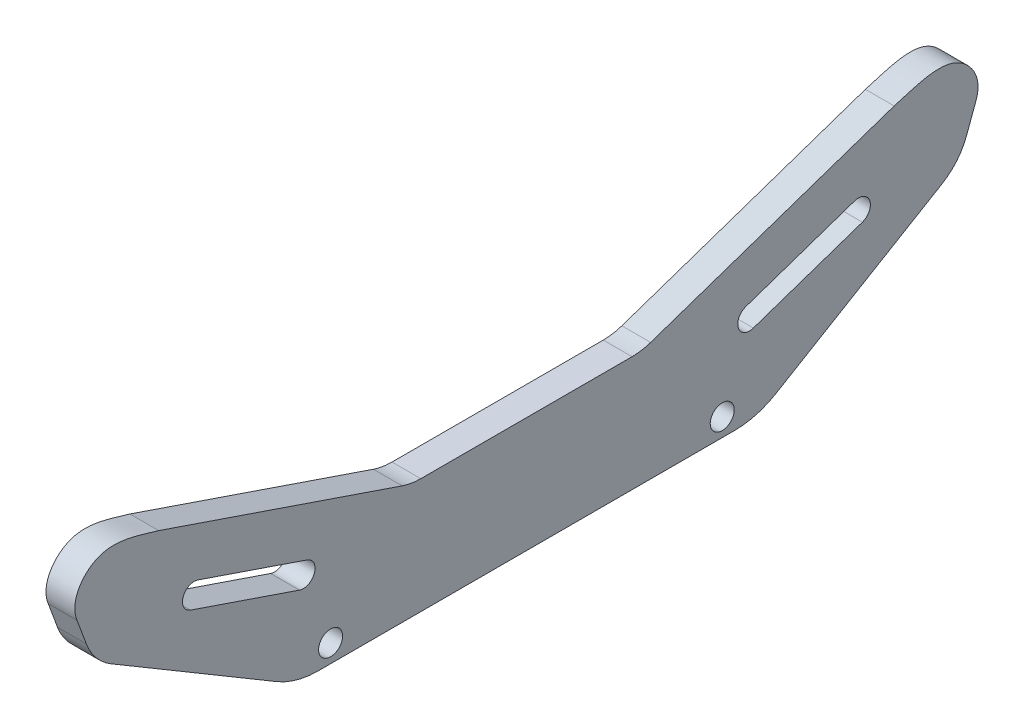
ISO-10303-21;
HEADER;
FILE_DESCRIPTION(('STEP AP214'),'2;1');
FILE_NAME('part.step','',(''),(''),'','','');
FILE_SCHEMA(('AUTOMOTIVE_DESIGN { 1 0 10303 214 1 1 1 1 }'));
ENDSEC;
DATA;
#1=APPLICATION_CONTEXT('core data for automotive mechanical design processes');
#2=APPLICATION_PROTOCOL_DEFINITION('international standard','automotive_design',2000,#1);
#3=PRODUCT_CONTEXT('',#1,'mechanical');
#4=PRODUCT('Part','Part','',(#3));
#5=PRODUCT_RELATED_PRODUCT_CATEGORY('part','',(#4));
#6=PRODUCT_DEFINITION_FORMATION('','',#4);
#7=PRODUCT_DEFINITION_CONTEXT('part definition',#1,'design');
#8=PRODUCT_DEFINITION('design','',#6,#7);
#9=PRODUCT_DEFINITION_SHAPE('','',#8);
#10=(LENGTH_UNIT() NAMED_UNIT(*) SI_UNIT(.MILLI.,.METRE.));
#11=(NAMED_UNIT(*) PLANE_ANGLE_UNIT() SI_UNIT($,.RADIAN.));
#12=(NAMED_UNIT(*) SI_UNIT($,.STERADIAN.) SOLID_ANGLE_UNIT());
#13=UNCERTAINTY_MEASURE_WITH_UNIT(LENGTH_MEASURE(1.E-05),#10,'distance_accuracy_value','');
#14=(GEOMETRIC_REPRESENTATION_CONTEXT(3) GLOBAL_UNCERTAINTY_ASSIGNED_CONTEXT((#13)) GLOBAL_UNIT_ASSIGNED_CONTEXT((#10,
#11,#12)) REPRESENTATION_CONTEXT('',''));
#15=CARTESIAN_POINT('',(0.,0.,0.));
#16=DIRECTION('',(0.,0.,1.));
#17=DIRECTION('',(1.,0.,0.));
#18=AXIS2_PLACEMENT_3D('',#15,#16,#17);
#19=CARTESIAN_POINT('',(6.35,0.,50.8));
#20=DIRECTION('',(0.,0.860067915947506,-0.510179556585437));
#21=DIRECTION('',(0.,0.510179556585437,0.860067915947507));
#22=AXIS2_PLACEMENT_3D('',#19,#20,#21);
#23=PLANE('',#22);
#24=DIRECTION('',(0.,-0.510179556585437,-0.860067915947506));
#25=VECTOR('',#24,1.);
#26=CARTESIAN_POINT('',(0.,0.,50.8));
#27=LINE('',#26,#25);
#28=CARTESIAN_POINT('',(0.,24.212684560183,91.6180862607409));
#29=VERTEX_POINT('',#28);
#30=CARTESIAN_POINT('',(0.,2.48799245445334,54.9942928868347));
#31=VERTEX_POINT('',#30);
#32=EDGE_CURVE('E269',#29,#31,#27,.T.);
#33=ORIENTED_EDGE('',*,*,#32,.T.);
#34=DIRECTION('',(-1.,0.,0.));
#35=VECTOR('',#34,1.);
#36=CARTESIAN_POINT('',(6.35,2.48799245445334,54.9942928868347));
#37=LINE('',#36,#35);
#38=CARTESIAN_POINT('',(6.35,2.48799245445334,54.9942928868347));
#39=VERTEX_POINT('',#38);
#40=EDGE_CURVE('E55',#31,#39,#37,.F.);
#41=ORIENTED_EDGE('',*,*,#40,.T.);
#42=DIRECTION('',(0.,-0.510179556585437,-0.860067915947506));
#43=VECTOR('',#42,1.);
#44=CARTESIAN_POINT('',(6.35,0.,50.8));
#45=LINE('',#44,#43);
#46=CARTESIAN_POINT('',(6.35,24.212684560183,91.6180862607409));
#47=VERTEX_POINT('',#46);
#48=EDGE_CURVE('E276',#47,#39,#45,.T.);
#49=ORIENTED_EDGE('',*,*,#48,.F.);
#50=DIRECTION('',(-1.,0.,0.));
#51=VECTOR('',#50,1.);
#52=CARTESIAN_POINT('',(6.35,24.212684560183,91.6180862607409));
#53=LINE('',#52,#51);
#54=EDGE_CURVE('E380',#47,#29,#53,.T.);
#55=ORIENTED_EDGE('',*,*,#54,.T.);
#56=EDGE_LOOP('',(#33,#41,#49,#55));
#57=FACE_BOUND('',#56,.T.);
#58=ADVANCED_FACE('F32',(#57),#23,.F.);
#59=CARTESIAN_POINT('',(6.35,0.,-50.8));
#60=DIRECTION('',(0.,1.,0.));
#61=DIRECTION('',(0.,0.,1.));
#62=AXIS2_PLACEMENT_3D('',#59,#60,#61);
#63=PLANE('',#62);
#64=DIRECTION('',(0.,0.,-1.));
#65=VECTOR('',#64,1.);
#66=CARTESIAN_POINT('',(6.35,0.,-50.8));
#67=LINE('',#66,#65);
#68=CARTESIAN_POINT('',(6.35,0.,45.9233003707457));
#69=VERTEX_POINT('',#68);
#70=CARTESIAN_POINT('',(6.35,0.,-45.9233003707457));
#71=VERTEX_POINT('',#70);
#72=EDGE_CURVE('E278',#69,#71,#67,.T.);
#73=ORIENTED_EDGE('',*,*,#72,.F.);
#74=DIRECTION('',(-1.,0.,0.));
#75=VECTOR('',#74,1.);
#76=CARTESIAN_POINT('',(6.35,0.,45.9233003707457));
#77=LINE('',#76,#75);
#78=CARTESIAN_POINT('',(0.,0.,45.9233003707457));
#79=VERTEX_POINT('',#78);
#80=EDGE_CURVE('E343',#69,#79,#77,.T.);
#81=ORIENTED_EDGE('',*,*,#80,.T.);
#82=DIRECTION('',(0.,0.,-1.));
#83=VECTOR('',#82,1.);
#84=CARTESIAN_POINT('',(0.,0.,-50.8));
#85=LINE('',#84,#83);
#86=CARTESIAN_POINT('',(0.,0.,-45.9233003707457));
#87=VERTEX_POINT('',#86);
#88=EDGE_CURVE('E434',#79,#87,#85,.T.);
#89=ORIENTED_EDGE('',*,*,#88,.T.);
#90=DIRECTION('',(-1.,0.,0.));
#91=VECTOR('',#90,1.);
#92=CARTESIAN_POINT('',(6.35,0.,-45.9233003707457));
#93=LINE('',#92,#91);
#94=EDGE_CURVE('E353',#87,#71,#93,.F.);
#95=ORIENTED_EDGE('',*,*,#94,.T.);
#96=EDGE_LOOP('',(#73,#81,#89,#95));
#97=FACE_BOUND('',#96,.T.);
#98=ADVANCED_FACE('F310',(#97),#63,.F.);
#99=CARTESIAN_POINT('',(6.35,0.,-50.8));
#100=DIRECTION('',(0.,0.860067915947506,0.510179556585437));
#101=DIRECTION('',(0.,-0.510179556585437,0.860067915947507));
#102=AXIS2_PLACEMENT_3D('',#99,#100,#101);
#103=PLANE('',#102);
#104=DIRECTION('',(0.,0.510179556585437,-0.860067915947506));
#105=VECTOR('',#104,1.);
#106=CARTESIAN_POINT('',(6.35,0.,-50.8));
#107=LINE('',#106,#105);
#108=CARTESIAN_POINT('',(6.35,2.48799245445333,-54.9942928868347));
#109=VERTEX_POINT('',#108);
#110=CARTESIAN_POINT('',(6.35,24.212684560183,-91.6180862607409));
#111=VERTEX_POINT('',#110);
#112=EDGE_CURVE('E281',#109,#111,#107,.T.);
#113=ORIENTED_EDGE('',*,*,#112,.F.);
#114=DIRECTION('',(-1.,0.,0.));
#115=VECTOR('',#114,1.);
#116=CARTESIAN_POINT('',(6.35,2.48799245445333,-54.9942928868347));
#117=LINE('',#116,#115);
#118=CARTESIAN_POINT('',(0.,2.48799245445333,-54.9942928868347));
#119=VERTEX_POINT('',#118);
#120=EDGE_CURVE('E11',#109,#119,#117,.T.);
#121=ORIENTED_EDGE('',*,*,#120,.T.);
#122=DIRECTION('',(0.,0.510179556585437,-0.860067915947506));
#123=VECTOR('',#122,1.);
#124=CARTESIAN_POINT('',(0.,0.,-50.8));
#125=LINE('',#124,#123);
#126=CARTESIAN_POINT('',(0.,24.212684560183,-91.6180862607409));
#127=VERTEX_POINT('',#126);
#128=EDGE_CURVE('E432',#119,#127,#125,.T.);
#129=ORIENTED_EDGE('',*,*,#128,.T.);
#130=DIRECTION('',(-1.,0.,0.));
#131=VECTOR('',#130,1.);
#132=CARTESIAN_POINT('',(6.35,24.212684560183,-91.6180862607409));
#133=LINE('',#132,#131);
#134=EDGE_CURVE('E363',#127,#111,#133,.F.);
#135=ORIENTED_EDGE('',*,*,#134,.T.);
#136=EDGE_LOOP('',(#113,#121,#129,#135));
#137=FACE_BOUND('',#136,.T.);
#138=ADVANCED_FACE('F306',(#137),#103,.F.);
#139=CARTESIAN_POINT('',(6.35,26.5105805189183,-95.4919117850742));
#140=DIRECTION('',(0.,0.346441344115629,0.938071636436875));
#141=DIRECTION('',(0.,-0.938071636436875,0.346441344115629));
#142=AXIS2_PLACEMENT_3D('',#139,#140,#141);
#143=PLANE('',#142);
#144=DIRECTION('',(0.,0.938071636436875,-0.346441344115629));
#145=VECTOR('',#144,1.);
#146=CARTESIAN_POINT('',(6.35,26.5105805189183,-95.4919117850742));
#147=LINE('',#146,#145);
#148=CARTESIAN_POINT('',(6.35,30.7357420224478,-97.0523156748542));
#149=VERTEX_POINT('',#148);
#150=CARTESIAN_POINT('',(6.35,36.2672226233802,-99.0951592060961));
#151=VERTEX_POINT('',#150);
#152=EDGE_CURVE('E283',#149,#151,#147,.T.);
#153=ORIENTED_EDGE('',*,*,#152,.F.);
#154=DIRECTION('',(-1.,0.,0.));
#155=VECTOR('',#154,1.);
#156=CARTESIAN_POINT('',(6.35,30.7357420224478,-97.0523156748542));
#157=LINE('',#156,#155);
#158=CARTESIAN_POINT('',(0.,30.7357420224478,-97.0523156748542));
#159=VERTEX_POINT('',#158);
#160=EDGE_CURVE('E366',#149,#159,#157,.T.);
#161=ORIENTED_EDGE('',*,*,#160,.T.);
#162=DIRECTION('',(0.,0.938071636436875,-0.346441344115629));
#163=VECTOR('',#162,1.);
#164=CARTESIAN_POINT('',(0.,26.5105805189183,-95.4919117850742));
#165=LINE('',#164,#163);
#166=CARTESIAN_POINT('',(0.,36.2672226233802,-99.0951592060961));
#167=VERTEX_POINT('',#166);
#168=EDGE_CURVE('E427',#159,#167,#165,.T.);
#169=ORIENTED_EDGE('',*,*,#168,.T.);
#170=DIRECTION('',(-1.,0.,0.));
#171=VECTOR('',#170,1.);
#172=CARTESIAN_POINT('',(6.35,36.2672226233802,-99.0951592060961));
#173=LINE('',#172,#171);
#174=EDGE_CURVE('E393',#151,#167,#173,.T.);
#175=ORIENTED_EDGE('',*,*,#174,.F.);
#176=EDGE_LOOP('',(#153,#161,#169,#175));
#177=FACE_BOUND('',#176,.T.);
#178=ADVANCED_FACE('F301',(#177),#143,.F.);
#179=CARTESIAN_POINT('',(6.35,36.2672226233802,-99.0951592060961));
#180=CARTESIAN_POINT('',(6.35,40.4841579147498,-100.787803101109));
#181=CARTESIAN_POINT('',(6.35,49.4796843817629,-94.5546512660423));
#182=CARTESIAN_POINT('',(6.35,45.3677386399269,-84.7934047414563));
#183=CARTESIAN_POINT('',(6.35,44.3838573916854,-81.095679658047));
#184=B_SPLINE_CURVE_WITH_KNOTS('',3,(#179,#180,#181,#182,#183),.UNSPECIFIED.,.F.,.F.,(4,1,4),
(0.,0.471218063435679,1.),.UNSPECIFIED.);
#185=DIRECTION('',(-1.,0.,0.));
#186=VECTOR('',#185,1.);
#187=SURFACE_OF_LINEAR_EXTRUSION('',#184,#186);
#188=CARTESIAN_POINT('',(0.,36.2672226233802,-99.0951592060961));
#189=CARTESIAN_POINT('',(0.,40.4841579147498,-100.787803101109));
#190=CARTESIAN_POINT('',(0.,49.4796843817629,-94.5546512660423));
#191=CARTESIAN_POINT('',(0.,45.3677386399269,-84.7934047414563));
#192=CARTESIAN_POINT('',(0.,44.3838573916854,-81.095679658047));
#193=B_SPLINE_CURVE_WITH_KNOTS('',3,(#188,#189,#190,#191,#192),.UNSPECIFIED.,.F.,.F.,(4,1,4),
(0.,0.471218063435679,1.),.UNSPECIFIED.);
#194=CARTESIAN_POINT('',(0.,44.3838573916854,-81.095679658047));
#195=VERTEX_POINT('',#194);
#196=EDGE_CURVE('E423',#167,#195,#193,.T.);
#197=ORIENTED_EDGE('',*,*,#196,.T.);
#198=DIRECTION('',(-1.,0.,0.));
#199=VECTOR('',#198,1.);
#200=CARTESIAN_POINT('',(6.35,44.3838573916854,-81.095679658047));
#201=LINE('',#200,#199);
#202=CARTESIAN_POINT('',(6.35,44.3838573916854,-81.095679658047));
#203=VERTEX_POINT('',#202);
#204=EDGE_CURVE('E396',#203,#195,#201,.T.);
#205=ORIENTED_EDGE('',*,*,#204,.F.);
#206=EDGE_CURVE('E285',#151,#203,#184,.T.);
#207=ORIENTED_EDGE('',*,*,#206,.F.);
#208=ORIENTED_EDGE('',*,*,#174,.T.);
#209=EDGE_LOOP('',(#197,#205,#207,#208));
#210=FACE_BOUND('',#209,.T.);
#211=ADVANCED_FACE('F296',(#210),#187,.F.);
#212=CARTESIAN_POINT('',(6.35,44.3838573916854,-81.095679658047));
#213=DIRECTION('',(0.,-0.946527346967318,-0.322623590958581));
#214=DIRECTION('',(0.,0.322623590958581,-0.946527346967318));
#215=AXIS2_PLACEMENT_3D('',#212,#213,#214);
#216=PLANE('',#215);
#217=DIRECTION('',(0.,-0.322623590958581,0.946527346967318));
#218=VECTOR('',#217,1.);
#219=CARTESIAN_POINT('',(0.,44.3838573916854,-81.095679658047));
#220=LINE('',#219,#218);
#221=CARTESIAN_POINT('',(0.,26.0791026935151,-27.3923814898387));
#222=VERTEX_POINT('',#221);
#223=EDGE_CURVE('E420',#195,#222,#220,.T.);
#224=ORIENTED_EDGE('',*,*,#223,.T.);
#225=DIRECTION('',(-1.,0.,0.));
#226=VECTOR('',#225,1.);
#227=CARTESIAN_POINT('',(6.35,26.0791026935151,-27.3923814898387));
#228=LINE('',#227,#226);
#229=CARTESIAN_POINT('',(6.35,26.0791026935151,-27.3923814898387));
#230=VERTEX_POINT('',#229);
#231=EDGE_CURVE('E386',#222,#230,#228,.F.);
#232=ORIENTED_EDGE('',*,*,#231,.T.);
#233=DIRECTION('',(0.,-0.322623590958581,0.946527346967318));
#234=VECTOR('',#233,1.);
#235=CARTESIAN_POINT('',(6.35,44.3838573916854,-81.095679658047));
#236=LINE('',#235,#234);
#237=EDGE_CURVE('E290',#203,#230,#236,.T.);
#238=ORIENTED_EDGE('',*,*,#237,.F.);
#239=ORIENTED_EDGE('',*,*,#204,.T.);
#240=EDGE_LOOP('',(#224,#232,#238,#239));
#241=FACE_BOUND('',#240,.T.);
#242=ADVANCED_FACE('F300',(#241),#216,.F.);
#243=CARTESIAN_POINT('',(6.35,25.4,25.4));
#244=DIRECTION('',(0.,-1.,0.));
#245=DIRECTION('',(0.,0.,-1.));
#246=AXIS2_PLACEMENT_3D('',#243,#244,#245);
#247=PLANE('',#246);
#248=DIRECTION('',(0.,0.,1.));
#249=VECTOR('',#248,1.);
#250=CARTESIAN_POINT('',(6.35,25.4,25.4));
#251=LINE('',#250,#249);
#252=CARTESIAN_POINT('',(6.35,25.4,-23.2950618846647));
#253=VERTEX_POINT('',#252);
#254=CARTESIAN_POINT('',(6.35,25.4,23.2950618846647));
#255=VERTEX_POINT('',#254);
#256=EDGE_CURVE('E469',#253,#255,#251,.T.);
#257=ORIENTED_EDGE('',*,*,#256,.F.);
#258=DIRECTION('',(-1.,0.,0.));
#259=VECTOR('',#258,1.);
#260=CARTESIAN_POINT('',(0.,25.4,-23.2950618846647));
#261=LINE('',#260,#259);
#262=CARTESIAN_POINT('',(0.,25.4,-23.2950618846647));
#263=VERTEX_POINT('',#262);
#264=EDGE_CURVE('E388',#253,#263,#261,.T.);
#265=ORIENTED_EDGE('',*,*,#264,.T.);
#266=DIRECTION('',(0.,0.,1.));
#267=VECTOR('',#266,1.);
#268=CARTESIAN_POINT('',(0.,25.4,25.4));
#269=LINE('',#268,#267);
#270=CARTESIAN_POINT('',(0.,25.4,23.2950618846647));
#271=VERTEX_POINT('',#270);
#272=EDGE_CURVE('E417',#263,#271,#269,.T.);
#273=ORIENTED_EDGE('',*,*,#272,.T.);
#274=DIRECTION('',(-1.,0.,0.));
#275=VECTOR('',#274,1.);
#276=CARTESIAN_POINT('',(6.35,25.4,23.2950618846647));
#277=LINE('',#276,#275);
#278=EDGE_CURVE('E391',#271,#255,#277,.F.);
#279=ORIENTED_EDGE('',*,*,#278,.T.);
#280=EDGE_LOOP('',(#257,#265,#273,#279));
#281=FACE_BOUND('',#280,.T.);
#282=ADVANCED_FACE('F459',(#281),#247,.F.);
#283=CARTESIAN_POINT('',(6.35,44.3838573916854,81.095679658047));
#284=DIRECTION('',(0.,-0.946527346967318,0.322623590958581));
#285=DIRECTION('',(0.,-0.322623590958581,-0.946527346967318));
#286=AXIS2_PLACEMENT_3D('',#283,#284,#285);
#287=PLANE('',#286);
#288=DIRECTION('',(0.,0.322623590958581,0.946527346967318));
#289=VECTOR('',#288,1.);
#290=CARTESIAN_POINT('',(6.35,44.3838573916854,81.095679658047));
#291=LINE('',#290,#289);
#292=CARTESIAN_POINT('',(6.35,26.0791026935151,27.3923814898387));
#293=VERTEX_POINT('',#292);
#294=CARTESIAN_POINT('',(6.35,44.3838573916854,81.095679658047));
#295=VERTEX_POINT('',#294);
#296=EDGE_CURVE('E445',#293,#295,#291,.T.);
#297=ORIENTED_EDGE('',*,*,#296,.F.);
#298=DIRECTION('',(-1.,0.,0.));
#299=VECTOR('',#298,1.);
#300=CARTESIAN_POINT('',(0.,26.0791026935151,27.3923814898387));
#301=LINE('',#300,#299);
#302=CARTESIAN_POINT('',(0.,26.0791026935151,27.3923814898387));
#303=VERTEX_POINT('',#302);
#304=EDGE_CURVE('E383',#293,#303,#301,.T.);
#305=ORIENTED_EDGE('',*,*,#304,.T.);
#306=DIRECTION('',(0.,0.322623590958581,0.946527346967318));
#307=VECTOR('',#306,1.);
#308=CARTESIAN_POINT('',(0.,44.3838573916854,81.095679658047));
#309=LINE('',#308,#307);
#310=CARTESIAN_POINT('',(0.,44.3838573916854,81.095679658047));
#311=VERTEX_POINT('',#310);
#312=EDGE_CURVE('E412',#303,#311,#309,.T.);
#313=ORIENTED_EDGE('',*,*,#312,.T.);
#314=DIRECTION('',(-1.,0.,0.));
#315=VECTOR('',#314,1.);
#316=CARTESIAN_POINT('',(6.35,44.3838573916854,81.095679658047));
#317=LINE('',#316,#315);
#318=EDGE_CURVE('E399',#295,#311,#317,.T.);
#319=ORIENTED_EDGE('',*,*,#318,.F.);
#320=EDGE_LOOP('',(#297,#305,#313,#319));
#321=FACE_BOUND('',#320,.T.);
#322=ADVANCED_FACE('F455',(#321),#287,.F.);
#323=CARTESIAN_POINT('',(6.35,44.3838573916854,81.095679658047));
#324=CARTESIAN_POINT('',(6.35,45.3677386399269,84.7934047414563));
#325=CARTESIAN_POINT('',(6.35,49.4796843817629,94.5546512660423));
#326=CARTESIAN_POINT('',(6.35,40.4841579147497,100.787803101109));
#327=CARTESIAN_POINT('',(6.35,36.2672226233802,99.0951592060961));
#328=B_SPLINE_CURVE_WITH_KNOTS('',3,(#323,#324,#325,#326,#327),.UNSPECIFIED.,.F.,.F.,(4,1,4),
(0.,0.528781936564321,1.),.UNSPECIFIED.);
#329=DIRECTION('',(-1.,0.,0.));
#330=VECTOR('',#329,1.);
#331=SURFACE_OF_LINEAR_EXTRUSION('',#328,#330);
#332=CARTESIAN_POINT('',(0.,44.3838573916854,81.095679658047));
#333=CARTESIAN_POINT('',(0.,45.3677386399269,84.7934047414563));
#334=CARTESIAN_POINT('',(0.,49.4796843817629,94.5546512660423));
#335=CARTESIAN_POINT('',(0.,40.4841579147497,100.787803101109));
#336=CARTESIAN_POINT('',(0.,36.2672226233802,99.0951592060961));
#337=B_SPLINE_CURVE_WITH_KNOTS('',3,(#332,#333,#334,#335,#336),.UNSPECIFIED.,.F.,.F.,(4,1,4),
(0.,0.528781936564321,1.),.UNSPECIFIED.);
#338=CARTESIAN_POINT('',(0.,36.2672226233802,99.0951592060961));
#339=VERTEX_POINT('',#338);
#340=EDGE_CURVE('E408',#311,#339,#337,.T.);
#341=ORIENTED_EDGE('',*,*,#340,.T.);
#342=DIRECTION('',(-1.,0.,0.));
#343=VECTOR('',#342,1.);
#344=CARTESIAN_POINT('',(6.35,36.2672226233802,99.0951592060961));
#345=LINE('',#344,#343);
#346=CARTESIAN_POINT('',(6.35,36.2672226233802,99.0951592060961));
#347=VERTEX_POINT('',#346);
#348=EDGE_CURVE('E402',#347,#339,#345,.T.);
#349=ORIENTED_EDGE('',*,*,#348,.F.);
#350=EDGE_CURVE('E440',#295,#347,#328,.T.);
#351=ORIENTED_EDGE('',*,*,#350,.F.);
#352=ORIENTED_EDGE('',*,*,#318,.T.);
#353=EDGE_LOOP('',(#341,#349,#351,#352));
#354=FACE_BOUND('',#353,.T.);
#355=ADVANCED_FACE('F450',(#354),#331,.F.);
#356=CARTESIAN_POINT('',(6.35,26.5105805189183,95.4919117850742));
#357=DIRECTION('',(0.,0.346441344115629,-0.938071636436875));
#358=DIRECTION('',(0.,0.938071636436875,0.346441344115629));
#359=AXIS2_PLACEMENT_3D('',#356,#357,#358);
#360=PLANE('',#359);
#361=DIRECTION('',(0.,-0.938071636436875,-0.346441344115629));
#362=VECTOR('',#361,1.);
#363=CARTESIAN_POINT('',(0.,26.5105805189183,95.4919117850742));
#364=LINE('',#363,#362);
#365=CARTESIAN_POINT('',(0.,30.7357420224478,97.0523156748542));
#366=VERTEX_POINT('',#365);
#367=EDGE_CURVE('E279',#339,#366,#364,.T.);
#368=ORIENTED_EDGE('',*,*,#367,.T.);
#369=DIRECTION('',(-1.,0.,0.));
#370=VECTOR('',#369,1.);
#371=CARTESIAN_POINT('',(6.35,30.7357420224478,97.0523156748542));
#372=LINE('',#371,#370);
#373=CARTESIAN_POINT('',(6.35,30.7357420224478,97.0523156748542));
#374=VERTEX_POINT('',#373);
#375=EDGE_CURVE('E373',#366,#374,#372,.F.);
#376=ORIENTED_EDGE('',*,*,#375,.T.);
#377=DIRECTION('',(0.,-0.938071636436875,-0.346441344115629));
#378=VECTOR('',#377,1.);
#379=CARTESIAN_POINT('',(6.35,26.5105805189183,95.4919117850742));
#380=LINE('',#379,#378);
#381=EDGE_CURVE('E405',#347,#374,#380,.T.);
#382=ORIENTED_EDGE('',*,*,#381,.F.);
#383=ORIENTED_EDGE('',*,*,#348,.T.);
#384=EDGE_LOOP('',(#368,#376,#382,#383));
#385=FACE_BOUND('',#384,.T.);
#386=ADVANCED_FACE('F454',(#385),#360,.F.);
#387=CARTESIAN_POINT('',(6.35,46.2630205489713,93.4399251856379));
#388=DIRECTION('',(1.,0.,0.));
#389=DIRECTION('',(0.,0.,-1.));
#390=AXIS2_PLACEMENT_3D('',#387,#388,#389);
#391=PLANE('',#390);
#392=CARTESIAN_POINT('',(6.35,3.99999999999999,43.18));
#393=DIRECTION('',(-1.,0.,0.));
#394=DIRECTION('',(0.,0.,1.));
#395=AXIS2_PLACEMENT_3D('',#392,#393,#394);
#396=CIRCLE('',#395,2.65);
#397=CARTESIAN_POINT('',(6.35,3.99999999999999,45.83));
#398=VERTEX_POINT('',#397);
#399=EDGE_CURVE('E544',#398,#398,#396,.T.);
#400=ORIENTED_EDGE('',*,*,#399,.T.);
#401=EDGE_LOOP('',(#400));
#402=FACE_BOUND('',#401,.T.);
#403=CARTESIAN_POINT('',(6.35,3.99999999999999,-43.18));
#404=DIRECTION('',(-1.,0.,0.));
#405=DIRECTION('',(0.,0.,1.));
#406=AXIS2_PLACEMENT_3D('',#403,#404,#405);
#407=CIRCLE('',#406,2.65);
#408=CARTESIAN_POINT('',(6.35,3.99999999999999,-40.53));
#409=VERTEX_POINT('',#408);
#410=EDGE_CURVE('E234',#409,#409,#407,.T.);
#411=ORIENTED_EDGE('',*,*,#410,.T.);
#412=EDGE_LOOP('',(#411));
#413=FACE_BOUND('',#412,.T.);
#414=CARTESIAN_POINT('',(6.35,28.1541346941639,73.2437760074164));
#415=DIRECTION('',(-1.,0.,0.));
#416=DIRECTION('',(0.,0.,-1.));
#417=AXIS2_PLACEMENT_3D('',#414,#415,#416);
#418=CIRCLE('',#417,2.59999999999997);
#419=CARTESIAN_POINT('',(6.35,25.6931635920489,74.0825973439087));
#420=VERTEX_POINT('',#419);
#421=CARTESIAN_POINT('',(6.35,30.6151057962789,72.4049546709241));
#422=VERTEX_POINT('',#421);
#423=EDGE_CURVE('E200',#420,#422,#418,.T.);
#424=ORIENTED_EDGE('',*,*,#423,.T.);
#425=DIRECTION('',(0.,-0.322623590958581,-0.946527346967318));
#426=VECTOR('',#425,1.);
#427=CARTESIAN_POINT('',(6.35,30.6151057962789,72.4049546709241));
#428=LINE('',#427,#426);
#429=CARTESIAN_POINT('',(6.35,22.420466585931,48.3631600579542));
#430=VERTEX_POINT('',#429);
#431=EDGE_CURVE('E212',#422,#430,#428,.T.);
#432=ORIENTED_EDGE('',*,*,#431,.T.);
#433=CARTESIAN_POINT('',(6.35,19.959495483816,49.2019813944465));
#434=DIRECTION('',(-1.,0.,0.));
#435=DIRECTION('',(0.,0.,-1.));
#436=AXIS2_PLACEMENT_3D('',#433,#434,#435);
#437=CIRCLE('',#436,2.59999999999998);
#438=CARTESIAN_POINT('',(6.35,17.4985243817009,50.0408027309388));
#439=VERTEX_POINT('',#438);
#440=EDGE_CURVE('E216',#430,#439,#437,.T.);
#441=ORIENTED_EDGE('',*,*,#440,.T.);
#442=DIRECTION('',(0.,0.322623590958582,0.946527346967318));
#443=VECTOR('',#442,1.);
#444=CARTESIAN_POINT('',(6.35,25.6931635920489,74.0825973439087));
#445=LINE('',#444,#443);
#446=EDGE_CURVE('E208',#439,#420,#445,.T.);
#447=ORIENTED_EDGE('',*,*,#446,.T.);
#448=EDGE_LOOP('',(#424,#432,#441,#447));
#449=FACE_BOUND('',#448,.T.);
#450=CARTESIAN_POINT('',(6.35,28.1541346941639,-73.2437760074164));
#451=DIRECTION('',(-1.,0.,0.));
#452=DIRECTION('',(0.,0.,1.));
#453=AXIS2_PLACEMENT_3D('',#450,#451,#452);
#454=CIRCLE('',#453,2.59999999999997);
#455=CARTESIAN_POINT('',(6.35,30.6151057962789,-72.4049546709241));
#456=VERTEX_POINT('',#455);
#457=CARTESIAN_POINT('',(6.35,25.6931635920489,-74.0825973439087));
#458=VERTEX_POINT('',#457);
#459=EDGE_CURVE('E244',#456,#458,#454,.T.);
#460=ORIENTED_EDGE('',*,*,#459,.T.);
#461=DIRECTION('',(0.,-0.322623590958582,0.946527346967318));
#462=VECTOR('',#461,1.);
#463=CARTESIAN_POINT('',(6.35,25.6931635920489,-74.0825973439087));
#464=LINE('',#463,#462);
#465=CARTESIAN_POINT('',(6.35,17.498524381701,-50.0408027309388));
#466=VERTEX_POINT('',#465);
#467=EDGE_CURVE('E247',#458,#466,#464,.T.);
#468=ORIENTED_EDGE('',*,*,#467,.T.);
#469=CARTESIAN_POINT('',(6.35,19.959495483816,-49.2019813944465));
#470=DIRECTION('',(-1.,0.,0.));
#471=DIRECTION('',(0.,0.,1.));
#472=AXIS2_PLACEMENT_3D('',#469,#470,#471);
#473=CIRCLE('',#472,2.59999999999998);
#474=CARTESIAN_POINT('',(6.35,22.420466585931,-48.3631600579542));
#475=VERTEX_POINT('',#474);
#476=EDGE_CURVE('E251',#466,#475,#473,.T.);
#477=ORIENTED_EDGE('',*,*,#476,.T.);
#478=DIRECTION('',(0.,0.322623590958581,-0.946527346967318));
#479=VECTOR('',#478,1.);
#480=CARTESIAN_POINT('',(6.35,30.6151057962789,-72.4049546709241));
#481=LINE('',#480,#479);
#482=EDGE_CURVE('E254',#475,#456,#481,.T.);
#483=ORIENTED_EDGE('',*,*,#482,.T.);
#484=EDGE_LOOP('',(#460,#468,#477,#483));
#485=FACE_BOUND('',#484,.T.);
#486=ORIENTED_EDGE('',*,*,#48,.T.);
#487=CARTESIAN_POINT('',(6.35,17.78,45.9233003707457));
#488=DIRECTION('',(1.,0.,0.));
#489=DIRECTION('',(0.,0.,-1.));
#490=AXIS2_PLACEMENT_3D('',#487,#488,#489);
#491=CIRCLE('',#490,17.78);
#492=EDGE_CURVE('E40',#39,#69,#491,.T.);
#493=ORIENTED_EDGE('',*,*,#492,.T.);
#494=ORIENTED_EDGE('',*,*,#72,.T.);
#495=CARTESIAN_POINT('',(6.35,17.78,-45.9233003707457));
#496=DIRECTION('',(1.,0.,0.));
#497=DIRECTION('',(0.,0.,-1.));
#498=AXIS2_PLACEMENT_3D('',#495,#496,#497);
#499=CIRCLE('',#498,17.78);
#500=EDGE_CURVE('E47',#71,#109,#499,.T.);
#501=ORIENTED_EDGE('',*,*,#500,.T.);
#502=ORIENTED_EDGE('',*,*,#112,.T.);
#503=CARTESIAN_POINT('',(6.35,35.1355470927163,-85.1388058921059));
#504=DIRECTION('',(1.,0.,0.));
#505=DIRECTION('',(0.,0.,-1.));
#506=AXIS2_PLACEMENT_3D('',#503,#504,#505);
#507=CIRCLE('',#506,12.7);
#508=EDGE_CURVE('E371',#111,#149,#507,.T.);
#509=ORIENTED_EDGE('',*,*,#508,.T.);
#510=ORIENTED_EDGE('',*,*,#152,.T.);
#511=ORIENTED_EDGE('',*,*,#206,.T.);
#512=ORIENTED_EDGE('',*,*,#237,.T.);
#513=CARTESIAN_POINT('',(6.35,38.1,-23.2950618846647));
#514=DIRECTION('',(1.,0.,0.));
#515=DIRECTION('',(0.,0.,-1.));
#516=AXIS2_PLACEMENT_3D('',#513,#514,#515);
#517=CIRCLE('',#516,12.7);
#518=EDGE_CURVE('E359',#230,#253,#517,.F.);
#519=ORIENTED_EDGE('',*,*,#518,.T.);
#520=ORIENTED_EDGE('',*,*,#256,.T.);
#521=CARTESIAN_POINT('',(6.35,38.1,23.2950618846647));
#522=DIRECTION('',(1.,0.,0.));
#523=DIRECTION('',(0.,0.,-1.));
#524=AXIS2_PLACEMENT_3D('',#521,#522,#523);
#525=CIRCLE('',#524,12.7);
#526=EDGE_CURVE('E355',#255,#293,#525,.F.);
#527=ORIENTED_EDGE('',*,*,#526,.T.);
#528=ORIENTED_EDGE('',*,*,#296,.T.);
#529=ORIENTED_EDGE('',*,*,#350,.T.);
#530=ORIENTED_EDGE('',*,*,#381,.T.);
#531=CARTESIAN_POINT('',(6.35,35.1355470927163,85.1388058921059));
#532=DIRECTION('',(1.,0.,0.));
#533=DIRECTION('',(0.,0.,-1.));
#534=AXIS2_PLACEMENT_3D('',#531,#532,#533);
#535=CIRCLE('',#534,12.7);
#536=EDGE_CURVE('E369',#374,#47,#535,.T.);
#537=ORIENTED_EDGE('',*,*,#536,.T.);
#538=EDGE_LOOP('',(#486,#493,#494,#501,#502,#509,#510,#511,#512,#519,#520,#527,#528,#529,#530,#537));
#539=FACE_BOUND('',#538,.T.);
#540=ADVANCED_FACE('F218',(#402,#413,#449,#485,#539),#391,.T.);
#541=CARTESIAN_POINT('',(0.,46.2630205489713,93.4399251856379));
#542=DIRECTION('',(1.,0.,0.));
#543=DIRECTION('',(0.,0.,-1.));
#544=AXIS2_PLACEMENT_3D('',#541,#542,#543);
#545=PLANE('',#544);
#546=CARTESIAN_POINT('',(0.,3.99999999999999,43.18));
#547=DIRECTION('',(-1.,0.,0.));
#548=DIRECTION('',(0.,0.,1.));
#549=AXIS2_PLACEMENT_3D('',#546,#547,#548);
#550=CIRCLE('',#549,2.65);
#551=CARTESIAN_POINT('',(0.,3.99999999999999,45.83));
#552=VERTEX_POINT('',#551);
#553=EDGE_CURVE('E547',#552,#552,#550,.T.);
#554=ORIENTED_EDGE('',*,*,#553,.F.);
#555=EDGE_LOOP('',(#554));
#556=FACE_BOUND('',#555,.T.);
#557=CARTESIAN_POINT('',(0.,3.99999999999999,-43.18));
#558=DIRECTION('',(-1.,0.,0.));
#559=DIRECTION('',(0.,0.,1.));
#560=AXIS2_PLACEMENT_3D('',#557,#558,#559);
#561=CIRCLE('',#560,2.65);
#562=CARTESIAN_POINT('',(0.,3.99999999999999,-40.53));
#563=VERTEX_POINT('',#562);
#564=EDGE_CURVE('E227',#563,#563,#561,.T.);
#565=ORIENTED_EDGE('',*,*,#564,.F.);
#566=EDGE_LOOP('',(#565));
#567=FACE_BOUND('',#566,.T.);
#568=DIRECTION('',(0.,-0.322623590958581,-0.946527346967318));
#569=VECTOR('',#568,1.);
#570=CARTESIAN_POINT('',(0.,30.6151057962789,72.4049546709241));
#571=LINE('',#570,#569);
#572=CARTESIAN_POINT('',(0.,30.6151057962789,72.4049546709241));
#573=VERTEX_POINT('',#572);
#574=CARTESIAN_POINT('',(0.,22.420466585931,48.3631600579542));
#575=VERTEX_POINT('',#574);
#576=EDGE_CURVE('E233',#573,#575,#571,.T.);
#577=ORIENTED_EDGE('',*,*,#576,.F.);
#578=CARTESIAN_POINT('',(0.,28.1541346941639,73.2437760074164));
#579=DIRECTION('',(-1.,0.,0.));
#580=DIRECTION('',(0.,0.,-1.));
#581=AXIS2_PLACEMENT_3D('',#578,#579,#580);
#582=CIRCLE('',#581,2.59999999999997);
#583=CARTESIAN_POINT('',(0.,25.6931635920489,74.0825973439087));
#584=VERTEX_POINT('',#583);
#585=EDGE_CURVE('E203',#584,#573,#582,.T.);
#586=ORIENTED_EDGE('',*,*,#585,.F.);
#587=DIRECTION('',(0.,0.322623590958582,0.946527346967318));
#588=VECTOR('',#587,1.);
#589=CARTESIAN_POINT('',(0.,25.6931635920489,74.0825973439087));
#590=LINE('',#589,#588);
#591=CARTESIAN_POINT('',(0.,17.4985243817009,50.0408027309388));
#592=VERTEX_POINT('',#591);
#593=EDGE_CURVE('E221',#592,#584,#590,.T.);
#594=ORIENTED_EDGE('',*,*,#593,.F.);
#595=CARTESIAN_POINT('',(0.,19.959495483816,49.2019813944465));
#596=DIRECTION('',(-1.,0.,0.));
#597=DIRECTION('',(0.,0.,-1.));
#598=AXIS2_PLACEMENT_3D('',#595,#596,#597);
#599=CIRCLE('',#598,2.59999999999998);
#600=EDGE_CURVE('E224',#575,#592,#599,.T.);
#601=ORIENTED_EDGE('',*,*,#600,.F.);
#602=EDGE_LOOP('',(#577,#586,#594,#601));
#603=FACE_BOUND('',#602,.T.);
#604=DIRECTION('',(0.,-0.322623590958582,0.946527346967318));
#605=VECTOR('',#604,1.);
#606=CARTESIAN_POINT('',(0.,25.6931635920489,-74.0825973439087));
#607=LINE('',#606,#605);
#608=CARTESIAN_POINT('',(0.,25.6931635920489,-74.0825973439087));
#609=VERTEX_POINT('',#608);
#610=CARTESIAN_POINT('',(0.,17.4985243817009,-50.0408027309388));
#611=VERTEX_POINT('',#610);
#612=EDGE_CURVE('E259',#609,#611,#607,.T.);
#613=ORIENTED_EDGE('',*,*,#612,.F.);
#614=CARTESIAN_POINT('',(0.,28.1541346941639,-73.2437760074164));
#615=DIRECTION('',(-1.,0.,0.));
#616=DIRECTION('',(0.,0.,1.));
#617=AXIS2_PLACEMENT_3D('',#614,#615,#616);
#618=CIRCLE('',#617,2.59999999999997);
#619=CARTESIAN_POINT('',(0.,30.6151057962789,-72.4049546709241));
#620=VERTEX_POINT('',#619);
#621=EDGE_CURVE('E240',#620,#609,#618,.T.);
#622=ORIENTED_EDGE('',*,*,#621,.F.);
#623=DIRECTION('',(0.,0.322623590958581,-0.946527346967318));
#624=VECTOR('',#623,1.);
#625=CARTESIAN_POINT('',(0.,30.6151057962789,-72.4049546709241));
#626=LINE('',#625,#624);
#627=CARTESIAN_POINT('',(0.,22.420466585931,-48.3631600579542));
#628=VERTEX_POINT('',#627);
#629=EDGE_CURVE('E248',#628,#620,#626,.T.);
#630=ORIENTED_EDGE('',*,*,#629,.F.);
#631=CARTESIAN_POINT('',(0.,19.959495483816,-49.2019813944465));
#632=DIRECTION('',(-1.,0.,0.));
#633=DIRECTION('',(0.,0.,1.));
#634=AXIS2_PLACEMENT_3D('',#631,#632,#633);
#635=CIRCLE('',#634,2.59999999999998);
#636=EDGE_CURVE('E262',#611,#628,#635,.T.);
#637=ORIENTED_EDGE('',*,*,#636,.F.);
#638=EDGE_LOOP('',(#613,#622,#630,#637));
#639=FACE_BOUND('',#638,.T.);
#640=ORIENTED_EDGE('',*,*,#88,.F.);
#641=CARTESIAN_POINT('',(0.,17.78,45.9233003707457));
#642=DIRECTION('',(1.,0.,0.));
#643=DIRECTION('',(0.,0.,-1.));
#644=AXIS2_PLACEMENT_3D('',#641,#642,#643);
#645=CIRCLE('',#644,17.78);
#646=EDGE_CURVE('E348',#79,#31,#645,.F.);
#647=ORIENTED_EDGE('',*,*,#646,.T.);
#648=ORIENTED_EDGE('',*,*,#32,.F.);
#649=CARTESIAN_POINT('',(0.,35.1355470927163,85.1388058921059));
#650=DIRECTION('',(1.,0.,0.));
#651=DIRECTION('',(0.,0.,-1.));
#652=AXIS2_PLACEMENT_3D('',#649,#650,#651);
#653=CIRCLE('',#652,12.7);
#654=EDGE_CURVE('E375',#29,#366,#653,.F.);
#655=ORIENTED_EDGE('',*,*,#654,.T.);
#656=ORIENTED_EDGE('',*,*,#367,.F.);
#657=ORIENTED_EDGE('',*,*,#340,.F.);
#658=ORIENTED_EDGE('',*,*,#312,.F.);
#659=CARTESIAN_POINT('',(0.,38.1,23.2950618846647));
#660=DIRECTION('',(1.,0.,0.));
#661=DIRECTION('',(0.,0.,-1.));
#662=AXIS2_PLACEMENT_3D('',#659,#660,#661);
#663=CIRCLE('',#662,12.7);
#664=EDGE_CURVE('E357',#303,#271,#663,.T.);
#665=ORIENTED_EDGE('',*,*,#664,.T.);
#666=ORIENTED_EDGE('',*,*,#272,.F.);
#667=CARTESIAN_POINT('',(0.,38.1,-23.2950618846647));
#668=DIRECTION('',(1.,0.,0.));
#669=DIRECTION('',(0.,0.,-1.));
#670=AXIS2_PLACEMENT_3D('',#667,#668,#669);
#671=CIRCLE('',#670,12.7);
#672=EDGE_CURVE('E361',#263,#222,#671,.T.);
#673=ORIENTED_EDGE('',*,*,#672,.T.);
#674=ORIENTED_EDGE('',*,*,#223,.F.);
#675=ORIENTED_EDGE('',*,*,#196,.F.);
#676=ORIENTED_EDGE('',*,*,#168,.F.);
#677=CARTESIAN_POINT('',(0.,35.1355470927163,-85.1388058921059));
#678=DIRECTION('',(1.,0.,0.));
#679=DIRECTION('',(0.,0.,-1.));
#680=AXIS2_PLACEMENT_3D('',#677,#678,#679);
#681=CIRCLE('',#680,12.7);
#682=EDGE_CURVE('E377',#159,#127,#681,.F.);
#683=ORIENTED_EDGE('',*,*,#682,.T.);
#684=ORIENTED_EDGE('',*,*,#128,.F.);
#685=CARTESIAN_POINT('',(0.,17.78,-45.9233003707457));
#686=DIRECTION('',(1.,0.,0.));
#687=DIRECTION('',(0.,0.,-1.));
#688=AXIS2_PLACEMENT_3D('',#685,#686,#687);
#689=CIRCLE('',#688,17.78);
#690=EDGE_CURVE('E350',#119,#87,#689,.F.);
#691=ORIENTED_EDGE('',*,*,#690,.T.);
#692=EDGE_LOOP('',(#640,#647,#648,#655,#656,#657,#658,#665,#666,#673,#674,#675,#676,#683,#684,#691));
#693=FACE_BOUND('',#692,.T.);
#694=ADVANCED_FACE('F479',(#556,#567,#603,#639,#693),#545,.F.);
#695=CARTESIAN_POINT('',(6.35,28.1541346941639,-73.2437760074164));
#696=DIRECTION('',(-1.,0.,0.));
#697=DIRECTION('',(0.,0.,1.));
#698=AXIS2_PLACEMENT_3D('',#695,#696,#697);
#699=CYLINDRICAL_SURFACE('',#698,2.59999999999997);
#700=ORIENTED_EDGE('',*,*,#621,.T.);
#701=DIRECTION('',(-1.,0.,0.));
#702=VECTOR('',#701,1.);
#703=CARTESIAN_POINT('',(6.35,25.6931635920489,-74.0825973439087));
#704=LINE('',#703,#702);
#705=EDGE_CURVE('E257',#458,#609,#704,.T.);
#706=ORIENTED_EDGE('',*,*,#705,.F.);
#707=ORIENTED_EDGE('',*,*,#459,.F.);
#708=DIRECTION('',(-1.,0.,0.));
#709=VECTOR('',#708,1.);
#710=CARTESIAN_POINT('',(6.35,30.6151057962789,-72.4049546709241));
#711=LINE('',#710,#709);
#712=EDGE_CURVE('E267',#456,#620,#711,.T.);
#713=ORIENTED_EDGE('',*,*,#712,.T.);
#714=EDGE_LOOP('',(#700,#706,#707,#713));
#715=FACE_BOUND('',#714,.T.);
#716=ADVANCED_FACE('F501',(#715),#699,.F.);
#717=CARTESIAN_POINT('',(6.35,30.6151057962789,-72.4049546709241));
#718=DIRECTION('',(0.,0.946527346967318,0.322623590958581));
#719=DIRECTION('',(0.,-0.322623590958581,0.946527346967319));
#720=AXIS2_PLACEMENT_3D('',#717,#718,#719);
#721=PLANE('',#720);
#722=ORIENTED_EDGE('',*,*,#629,.T.);
#723=ORIENTED_EDGE('',*,*,#712,.F.);
#724=ORIENTED_EDGE('',*,*,#482,.F.);
#725=DIRECTION('',(-1.,0.,0.));
#726=VECTOR('',#725,1.);
#727=CARTESIAN_POINT('',(6.35,22.420466585931,-48.3631600579542));
#728=LINE('',#727,#726);
#729=EDGE_CURVE('E270',#475,#628,#728,.T.);
#730=ORIENTED_EDGE('',*,*,#729,.T.);
#731=EDGE_LOOP('',(#722,#723,#724,#730));
#732=FACE_BOUND('',#731,.T.);
#733=ADVANCED_FACE('F509',(#732),#721,.F.);
#734=CARTESIAN_POINT('',(6.35,19.959495483816,-49.2019813944465));
#735=DIRECTION('',(-1.,0.,0.));
#736=DIRECTION('',(0.,0.,1.));
#737=AXIS2_PLACEMENT_3D('',#734,#735,#736);
#738=CYLINDRICAL_SURFACE('',#737,2.59999999999998);
#739=ORIENTED_EDGE('',*,*,#636,.T.);
#740=ORIENTED_EDGE('',*,*,#729,.F.);
#741=ORIENTED_EDGE('',*,*,#476,.F.);
#742=DIRECTION('',(-1.,0.,0.));
#743=VECTOR('',#742,1.);
#744=CARTESIAN_POINT('',(6.35,17.4985243817009,-50.0408027309388));
#745=LINE('',#744,#743);
#746=EDGE_CURVE('E272',#466,#611,#745,.T.);
#747=ORIENTED_EDGE('',*,*,#746,.T.);
#748=EDGE_LOOP('',(#739,#740,#741,#747));
#749=FACE_BOUND('',#748,.T.);
#750=ADVANCED_FACE('F514',(#749),#738,.F.);
#751=CARTESIAN_POINT('',(6.35,25.6931635920489,-74.0825973439087));
#752=DIRECTION('',(0.,-0.946527346967318,-0.322623590958582));
#753=DIRECTION('',(0.,0.322623590958582,-0.946527346967318));
#754=AXIS2_PLACEMENT_3D('',#751,#752,#753);
#755=PLANE('',#754);
#756=ORIENTED_EDGE('',*,*,#612,.T.);
#757=ORIENTED_EDGE('',*,*,#746,.F.);
#758=ORIENTED_EDGE('',*,*,#467,.F.);
#759=ORIENTED_EDGE('',*,*,#705,.T.);
#760=EDGE_LOOP('',(#756,#757,#758,#759));
#761=FACE_BOUND('',#760,.T.);
#762=ADVANCED_FACE('F511',(#761),#755,.F.);
#763=CARTESIAN_POINT('',(6.35,28.1541346941639,73.2437760074164));
#764=DIRECTION('',(-1.,0.,0.));
#765=DIRECTION('',(0.,0.,1.));
#766=AXIS2_PLACEMENT_3D('',#763,#764,#765);
#767=CYLINDRICAL_SURFACE('',#766,2.59999999999997);
#768=ORIENTED_EDGE('',*,*,#585,.T.);
#769=DIRECTION('',(-1.,0.,0.));
#770=VECTOR('',#769,1.);
#771=CARTESIAN_POINT('',(6.35,30.6151057962789,72.4049546709241));
#772=LINE('',#771,#770);
#773=EDGE_CURVE('E196',#422,#573,#772,.T.);
#774=ORIENTED_EDGE('',*,*,#773,.F.);
#775=ORIENTED_EDGE('',*,*,#423,.F.);
#776=DIRECTION('',(-1.,0.,0.));
#777=VECTOR('',#776,1.);
#778=CARTESIAN_POINT('',(6.35,25.6931635920489,74.0825973439087));
#779=LINE('',#778,#777);
#780=EDGE_CURVE('E238',#420,#584,#779,.T.);
#781=ORIENTED_EDGE('',*,*,#780,.T.);
#782=EDGE_LOOP('',(#768,#774,#775,#781));
#783=FACE_BOUND('',#782,.T.);
#784=ADVANCED_FACE('F198',(#783),#767,.F.);
#785=CARTESIAN_POINT('',(6.35,25.6931635920489,74.0825973439087));
#786=DIRECTION('',(0.,-0.946527346967318,0.322623590958582));
#787=DIRECTION('',(0.,-0.322623590958582,-0.946527346967318));
#788=AXIS2_PLACEMENT_3D('',#785,#786,#787);
#789=PLANE('',#788);
#790=ORIENTED_EDGE('',*,*,#593,.T.);
#791=ORIENTED_EDGE('',*,*,#780,.F.);
#792=ORIENTED_EDGE('',*,*,#446,.F.);
#793=DIRECTION('',(-1.,0.,0.));
#794=VECTOR('',#793,1.);
#795=CARTESIAN_POINT('',(6.35,17.4985243817009,50.0408027309388));
#796=LINE('',#795,#794);
#797=EDGE_CURVE('E241',#439,#592,#796,.T.);
#798=ORIENTED_EDGE('',*,*,#797,.T.);
#799=EDGE_LOOP('',(#790,#791,#792,#798));
#800=FACE_BOUND('',#799,.T.);
#801=ADVANCED_FACE('F524',(#800),#789,.F.);
#802=CARTESIAN_POINT('',(6.35,19.959495483816,49.2019813944465));
#803=DIRECTION('',(-1.,0.,0.));
#804=DIRECTION('',(0.,0.,1.));
#805=AXIS2_PLACEMENT_3D('',#802,#803,#804);
#806=CYLINDRICAL_SURFACE('',#805,2.59999999999998);
#807=ORIENTED_EDGE('',*,*,#600,.T.);
#808=ORIENTED_EDGE('',*,*,#797,.F.);
#809=ORIENTED_EDGE('',*,*,#440,.F.);
#810=DIRECTION('',(-1.,0.,0.));
#811=VECTOR('',#810,1.);
#812=CARTESIAN_POINT('',(6.35,22.420466585931,48.3631600579542));
#813=LINE('',#812,#811);
#814=EDGE_CURVE('E207',#430,#575,#813,.T.);
#815=ORIENTED_EDGE('',*,*,#814,.T.);
#816=EDGE_LOOP('',(#807,#808,#809,#815));
#817=FACE_BOUND('',#816,.T.);
#818=ADVANCED_FACE('F528',(#817),#806,.F.);
#819=CARTESIAN_POINT('',(6.35,30.6151057962789,72.4049546709241));
#820=DIRECTION('',(0.,0.946527346967318,-0.322623590958581));
#821=DIRECTION('',(0.,0.322623590958581,0.946527346967319));
#822=AXIS2_PLACEMENT_3D('',#819,#820,#821);
#823=PLANE('',#822);
#824=ORIENTED_EDGE('',*,*,#576,.T.);
#825=ORIENTED_EDGE('',*,*,#814,.F.);
#826=ORIENTED_EDGE('',*,*,#431,.F.);
#827=ORIENTED_EDGE('',*,*,#773,.T.);
#828=EDGE_LOOP('',(#824,#825,#826,#827));
#829=FACE_BOUND('',#828,.T.);
#830=ADVANCED_FACE('F213',(#829),#823,.F.);
#831=CARTESIAN_POINT('',(6.35,3.99999999999999,-43.18));
#832=DIRECTION('',(-1.,0.,0.));
#833=DIRECTION('',(0.,0.,1.));
#834=AXIS2_PLACEMENT_3D('',#831,#832,#833);
#835=CYLINDRICAL_SURFACE('',#834,2.65);
#836=ORIENTED_EDGE('',*,*,#410,.F.);
#837=EDGE_LOOP('',(#836));
#838=FACE_BOUND('',#837,.T.);
#839=ORIENTED_EDGE('',*,*,#564,.T.);
#840=EDGE_LOOP('',(#839));
#841=FACE_BOUND('',#840,.T.);
#842=ADVANCED_FACE('F527',(#838,#841),#835,.F.);
#843=CARTESIAN_POINT('',(6.35,3.99999999999999,43.18));
#844=DIRECTION('',(-1.,0.,0.));
#845=DIRECTION('',(0.,0.,1.));
#846=AXIS2_PLACEMENT_3D('',#843,#844,#845);
#847=CYLINDRICAL_SURFACE('',#846,2.65);
#848=ORIENTED_EDGE('',*,*,#399,.F.);
#849=EDGE_LOOP('',(#848));
#850=FACE_BOUND('',#849,.T.);
#851=ORIENTED_EDGE('',*,*,#553,.T.);
#852=EDGE_LOOP('',(#851));
#853=FACE_BOUND('',#852,.T.);
#854=ADVANCED_FACE('F321',(#850,#853),#847,.F.);
#855=CARTESIAN_POINT('',(6.35,38.1,-23.2950618846647));
#856=DIRECTION('',(1.,0.,0.));
#857=DIRECTION('',(0.,0.,-1.));
#858=AXIS2_PLACEMENT_3D('',#855,#856,#857);
#859=CYLINDRICAL_SURFACE('',#858,12.7);
#860=ORIENTED_EDGE('',*,*,#518,.F.);
#861=ORIENTED_EDGE('',*,*,#231,.F.);
#862=ORIENTED_EDGE('',*,*,#672,.F.);
#863=ORIENTED_EDGE('',*,*,#264,.F.);
#864=EDGE_LOOP('',(#860,#861,#862,#863));
#865=FACE_BOUND('',#864,.T.);
#866=ADVANCED_FACE('F317',(#865),#859,.F.);
#867=CARTESIAN_POINT('',(6.35,38.1,23.2950618846647));
#868=DIRECTION('',(1.,0.,0.));
#869=DIRECTION('',(0.,0.,-1.));
#870=AXIS2_PLACEMENT_3D('',#867,#868,#869);
#871=CYLINDRICAL_SURFACE('',#870,12.7);
#872=ORIENTED_EDGE('',*,*,#526,.F.);
#873=ORIENTED_EDGE('',*,*,#278,.F.);
#874=ORIENTED_EDGE('',*,*,#664,.F.);
#875=ORIENTED_EDGE('',*,*,#304,.F.);
#876=EDGE_LOOP('',(#872,#873,#874,#875));
#877=FACE_BOUND('',#876,.T.);
#878=ADVANCED_FACE('F320',(#877),#871,.F.);
#879=CARTESIAN_POINT('',(6.35,35.1355470927163,85.1388058921059));
#880=DIRECTION('',(-1.,0.,0.));
#881=DIRECTION('',(0.,0.,1.));
#882=AXIS2_PLACEMENT_3D('',#879,#880,#881);
#883=CYLINDRICAL_SURFACE('',#882,12.7);
#884=ORIENTED_EDGE('',*,*,#536,.F.);
#885=ORIENTED_EDGE('',*,*,#375,.F.);
#886=ORIENTED_EDGE('',*,*,#654,.F.);
#887=ORIENTED_EDGE('',*,*,#54,.F.);
#888=EDGE_LOOP('',(#884,#885,#886,#887));
#889=FACE_BOUND('',#888,.T.);
#890=ADVANCED_FACE('F325',(#889),#883,.T.);
#891=CARTESIAN_POINT('',(6.35,35.1355470927163,-85.1388058921059));
#892=DIRECTION('',(-1.,0.,0.));
#893=DIRECTION('',(0.,0.,1.));
#894=AXIS2_PLACEMENT_3D('',#891,#892,#893);
#895=CYLINDRICAL_SURFACE('',#894,12.7);
#896=ORIENTED_EDGE('',*,*,#508,.F.);
#897=ORIENTED_EDGE('',*,*,#134,.F.);
#898=ORIENTED_EDGE('',*,*,#682,.F.);
#899=ORIENTED_EDGE('',*,*,#160,.F.);
#900=EDGE_LOOP('',(#896,#897,#898,#899));
#901=FACE_BOUND('',#900,.T.);
#902=ADVANCED_FACE('F329',(#901),#895,.T.);
#903=CARTESIAN_POINT('',(6.35,17.78,45.9233003707457));
#904=DIRECTION('',(-1.,0.,0.));
#905=DIRECTION('',(0.,0.,1.));
#906=AXIS2_PLACEMENT_3D('',#903,#904,#905);
#907=CYLINDRICAL_SURFACE('',#906,17.78);
#908=ORIENTED_EDGE('',*,*,#492,.F.);
#909=ORIENTED_EDGE('',*,*,#40,.F.);
#910=ORIENTED_EDGE('',*,*,#646,.F.);
#911=ORIENTED_EDGE('',*,*,#80,.F.);
#912=EDGE_LOOP('',(#908,#909,#910,#911));
#913=FACE_BOUND('',#912,.T.);
#914=ADVANCED_FACE('F332',(#913),#907,.T.);
#915=CARTESIAN_POINT('',(6.35,17.78,-45.9233003707457));
#916=DIRECTION('',(-1.,0.,0.));
#917=DIRECTION('',(0.,0.,1.));
#918=AXIS2_PLACEMENT_3D('',#915,#916,#917);
#919=CYLINDRICAL_SURFACE('',#918,17.78);
#920=ORIENTED_EDGE('',*,*,#500,.F.);
#921=ORIENTED_EDGE('',*,*,#94,.F.);
#922=ORIENTED_EDGE('',*,*,#690,.F.);
#923=ORIENTED_EDGE('',*,*,#120,.F.);
#924=EDGE_LOOP('',(#920,#921,#922,#923));
#925=FACE_BOUND('',#924,.T.);
#926=ADVANCED_FACE('F34',(#925),#919,.T.);
#927=CLOSED_SHELL('',(#58,#98,#138,#178,#211,#242,#282,#322,#355,#386,#540,#694,#716,#733,#750,
#762,#784,#801,#818,#830,#842,#854,#866,#878,#890,#902,#914,#926));
#928=MANIFOLD_SOLID_BREP('B2',#927);
#929=ADVANCED_BREP_SHAPE_REPRESENTATION('',(#18,#928),#14);
#930=SHAPE_DEFINITION_REPRESENTATION(#9,#929);
ENDSEC;
END-ISO-10303-21;
